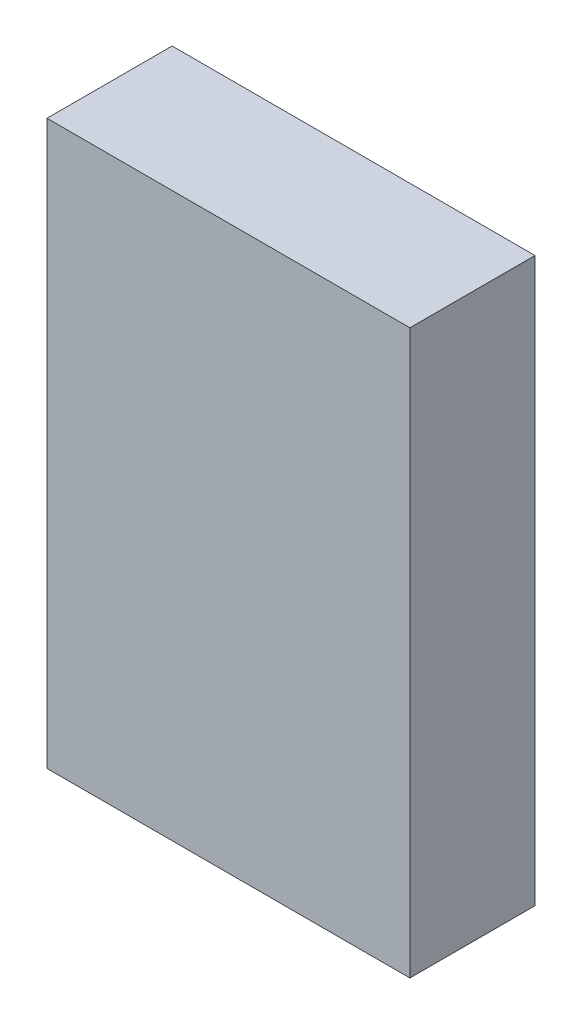
ISO-10303-21;
HEADER;
FILE_DESCRIPTION(('STEP AP214'),'2;1');
FILE_NAME('part.step','',(''),(''),'','','');
FILE_SCHEMA(('AUTOMOTIVE_DESIGN { 1 0 10303 214 1 1 1 1 }'));
ENDSEC;
DATA;
#1=APPLICATION_CONTEXT('core data for automotive mechanical design processes');
#2=APPLICATION_PROTOCOL_DEFINITION('international standard','automotive_design',2000,#1);
#3=PRODUCT_CONTEXT('',#1,'mechanical');
#4=PRODUCT('Part','Part','',(#3));
#5=PRODUCT_RELATED_PRODUCT_CATEGORY('part','',(#4));
#6=PRODUCT_DEFINITION_FORMATION('','',#4);
#7=PRODUCT_DEFINITION_CONTEXT('part definition',#1,'design');
#8=PRODUCT_DEFINITION('design','',#6,#7);
#9=PRODUCT_DEFINITION_SHAPE('','',#8);
#10=(LENGTH_UNIT() NAMED_UNIT(*) SI_UNIT(.MILLI.,.METRE.));
#11=(NAMED_UNIT(*) PLANE_ANGLE_UNIT() SI_UNIT($,.RADIAN.));
#12=(NAMED_UNIT(*) SI_UNIT($,.STERADIAN.) SOLID_ANGLE_UNIT());
#13=UNCERTAINTY_MEASURE_WITH_UNIT(LENGTH_MEASURE(1.E-05),#10,'distance_accuracy_value','');
#14=(GEOMETRIC_REPRESENTATION_CONTEXT(3) GLOBAL_UNCERTAINTY_ASSIGNED_CONTEXT((#13)) GLOBAL_UNIT_ASSIGNED_CONTEXT((#10,
#11,#12)) REPRESENTATION_CONTEXT('',''));
#15=CARTESIAN_POINT('',(0.,0.,0.));
#16=DIRECTION('',(0.,0.,1.));
#17=DIRECTION('',(1.,0.,0.));
#18=AXIS2_PLACEMENT_3D('',#15,#16,#17);
#19=CARTESIAN_POINT('',(-29.,-45.,20.));
#20=DIRECTION('',(1.,0.,0.));
#21=DIRECTION('',(0.,0.,-1.));
#22=AXIS2_PLACEMENT_3D('',#19,#20,#21);
#23=PLANE('',#22);
#24=DIRECTION('',(0.,-1.,0.));
#25=VECTOR('',#24,1.);
#26=CARTESIAN_POINT('',(-29.,-45.,0.));
#27=LINE('',#26,#25);
#28=CARTESIAN_POINT('',(-29.,45.,0.));
#29=VERTEX_POINT('',#28);
#30=CARTESIAN_POINT('',(-29.,-45.,0.));
#31=VERTEX_POINT('',#30);
#32=EDGE_CURVE('E98',#29,#31,#27,.T.);
#33=ORIENTED_EDGE('',*,*,#32,.T.);
#34=DIRECTION('',(0.,0.,-1.));
#35=VECTOR('',#34,1.);
#36=CARTESIAN_POINT('',(-29.,-45.,20.));
#37=LINE('',#36,#35);
#38=CARTESIAN_POINT('',(-29.,-45.,20.));
#39=VERTEX_POINT('',#38);
#40=EDGE_CURVE('E11',#39,#31,#37,.T.);
#41=ORIENTED_EDGE('',*,*,#40,.F.);
#42=DIRECTION('',(0.,-1.,0.));
#43=VECTOR('',#42,1.);
#44=CARTESIAN_POINT('',(-29.,-45.,20.));
#45=LINE('',#44,#43);
#46=CARTESIAN_POINT('',(-29.,45.,20.));
#47=VERTEX_POINT('',#46);
#48=EDGE_CURVE('E86',#47,#39,#45,.T.);
#49=ORIENTED_EDGE('',*,*,#48,.F.);
#50=DIRECTION('',(0.,0.,-1.));
#51=VECTOR('',#50,1.);
#52=CARTESIAN_POINT('',(-29.,45.,20.));
#53=LINE('',#52,#51);
#54=EDGE_CURVE('E94',#47,#29,#53,.T.);
#55=ORIENTED_EDGE('',*,*,#54,.T.);
#56=EDGE_LOOP('',(#33,#41,#49,#55));
#57=FACE_BOUND('',#56,.T.);
#58=ADVANCED_FACE('F35',(#57),#23,.F.);
#59=CARTESIAN_POINT('',(29.,-45.,20.));
#60=DIRECTION('',(0.,1.,0.));
#61=DIRECTION('',(0.,0.,1.));
#62=AXIS2_PLACEMENT_3D('',#59,#60,#61);
#63=PLANE('',#62);
#64=DIRECTION('',(1.,0.,0.));
#65=VECTOR('',#64,1.);
#66=CARTESIAN_POINT('',(29.,-45.,0.));
#67=LINE('',#66,#65);
#68=CARTESIAN_POINT('',(29.,-45.,0.));
#69=VERTEX_POINT('',#68);
#70=EDGE_CURVE('E90',#31,#69,#67,.T.);
#71=ORIENTED_EDGE('',*,*,#70,.T.);
#72=DIRECTION('',(0.,0.,-1.));
#73=VECTOR('',#72,1.);
#74=CARTESIAN_POINT('',(29.,-45.,20.));
#75=LINE('',#74,#73);
#76=CARTESIAN_POINT('',(29.,-45.,20.));
#77=VERTEX_POINT('',#76);
#78=EDGE_CURVE('E43',#77,#69,#75,.T.);
#79=ORIENTED_EDGE('',*,*,#78,.F.);
#80=DIRECTION('',(1.,0.,0.));
#81=VECTOR('',#80,1.);
#82=CARTESIAN_POINT('',(29.,-45.,20.));
#83=LINE('',#82,#81);
#84=EDGE_CURVE('E81',#39,#77,#83,.T.);
#85=ORIENTED_EDGE('',*,*,#84,.F.);
#86=ORIENTED_EDGE('',*,*,#40,.T.);
#87=EDGE_LOOP('',(#71,#79,#85,#86));
#88=FACE_BOUND('',#87,.T.);
#89=ADVANCED_FACE('F89',(#88),#63,.F.);
#90=CARTESIAN_POINT('',(29.,-45.,20.));
#91=DIRECTION('',(-1.,0.,0.));
#92=DIRECTION('',(0.,0.,1.));
#93=AXIS2_PLACEMENT_3D('',#90,#91,#92);
#94=PLANE('',#93);
#95=DIRECTION('',(0.,1.,0.));
#96=VECTOR('',#95,1.);
#97=CARTESIAN_POINT('',(29.,-45.,0.));
#98=LINE('',#97,#96);
#99=CARTESIAN_POINT('',(29.,45.,0.));
#100=VERTEX_POINT('',#99);
#101=EDGE_CURVE('E68',#69,#100,#98,.T.);
#102=ORIENTED_EDGE('',*,*,#101,.T.);
#103=DIRECTION('',(0.,0.,-1.));
#104=VECTOR('',#103,1.);
#105=CARTESIAN_POINT('',(29.,45.,20.));
#106=LINE('',#105,#104);
#107=CARTESIAN_POINT('',(29.,45.,20.));
#108=VERTEX_POINT('',#107);
#109=EDGE_CURVE('E91',#108,#100,#106,.T.);
#110=ORIENTED_EDGE('',*,*,#109,.F.);
#111=DIRECTION('',(0.,1.,0.));
#112=VECTOR('',#111,1.);
#113=CARTESIAN_POINT('',(29.,-45.,20.));
#114=LINE('',#113,#112);
#115=EDGE_CURVE('E84',#77,#108,#114,.T.);
#116=ORIENTED_EDGE('',*,*,#115,.F.);
#117=ORIENTED_EDGE('',*,*,#78,.T.);
#118=EDGE_LOOP('',(#102,#110,#116,#117));
#119=FACE_BOUND('',#118,.T.);
#120=ADVANCED_FACE('F92',(#119),#94,.F.);
#121=CARTESIAN_POINT('',(29.,45.,20.));
#122=DIRECTION('',(0.,-1.,0.));
#123=DIRECTION('',(0.,0.,-1.));
#124=AXIS2_PLACEMENT_3D('',#121,#122,#123);
#125=PLANE('',#124);
#126=DIRECTION('',(-1.,0.,0.));
#127=VECTOR('',#126,1.);
#128=CARTESIAN_POINT('',(29.,45.,0.));
#129=LINE('',#128,#127);
#130=EDGE_CURVE('E74',#100,#29,#129,.T.);
#131=ORIENTED_EDGE('',*,*,#130,.T.);
#132=ORIENTED_EDGE('',*,*,#54,.F.);
#133=DIRECTION('',(-1.,0.,0.));
#134=VECTOR('',#133,1.);
#135=CARTESIAN_POINT('',(29.,45.,20.));
#136=LINE('',#135,#134);
#137=EDGE_CURVE('E51',#108,#47,#136,.T.);
#138=ORIENTED_EDGE('',*,*,#137,.F.);
#139=ORIENTED_EDGE('',*,*,#109,.T.);
#140=EDGE_LOOP('',(#131,#132,#138,#139));
#141=FACE_BOUND('',#140,.T.);
#142=ADVANCED_FACE('F105',(#141),#125,.F.);
#143=CARTESIAN_POINT('',(0.,0.,20.));
#144=DIRECTION('',(0.,0.,1.));
#145=DIRECTION('',(1.,0.,0.));
#146=AXIS2_PLACEMENT_3D('',#143,#144,#145);
#147=PLANE('',#146);
#148=ORIENTED_EDGE('',*,*,#48,.T.);
#149=ORIENTED_EDGE('',*,*,#84,.T.);
#150=ORIENTED_EDGE('',*,*,#115,.T.);
#151=ORIENTED_EDGE('',*,*,#137,.T.);
#152=EDGE_LOOP('',(#148,#149,#150,#151));
#153=FACE_BOUND('',#152,.T.);
#154=ADVANCED_FACE('F82',(#153),#147,.T.);
#155=CARTESIAN_POINT('',(0.,0.,0.));
#156=DIRECTION('',(0.,0.,1.));
#157=DIRECTION('',(1.,0.,0.));
#158=AXIS2_PLACEMENT_3D('',#155,#156,#157);
#159=PLANE('',#158);
#160=ORIENTED_EDGE('',*,*,#32,.F.);
#161=ORIENTED_EDGE('',*,*,#130,.F.);
#162=ORIENTED_EDGE('',*,*,#101,.F.);
#163=ORIENTED_EDGE('',*,*,#70,.F.);
#164=EDGE_LOOP('',(#160,#161,#162,#163));
#165=FACE_BOUND('',#164,.T.);
#166=ADVANCED_FACE('F108',(#165),#159,.F.);
#167=CLOSED_SHELL('',(#58,#89,#120,#142,#154,#166));
#168=MANIFOLD_SOLID_BREP('B2',#167);
#169=ADVANCED_BREP_SHAPE_REPRESENTATION('',(#18,#168),#14);
#170=SHAPE_DEFINITION_REPRESENTATION(#9,#169);
ENDSEC;
END-ISO-10303-21;
